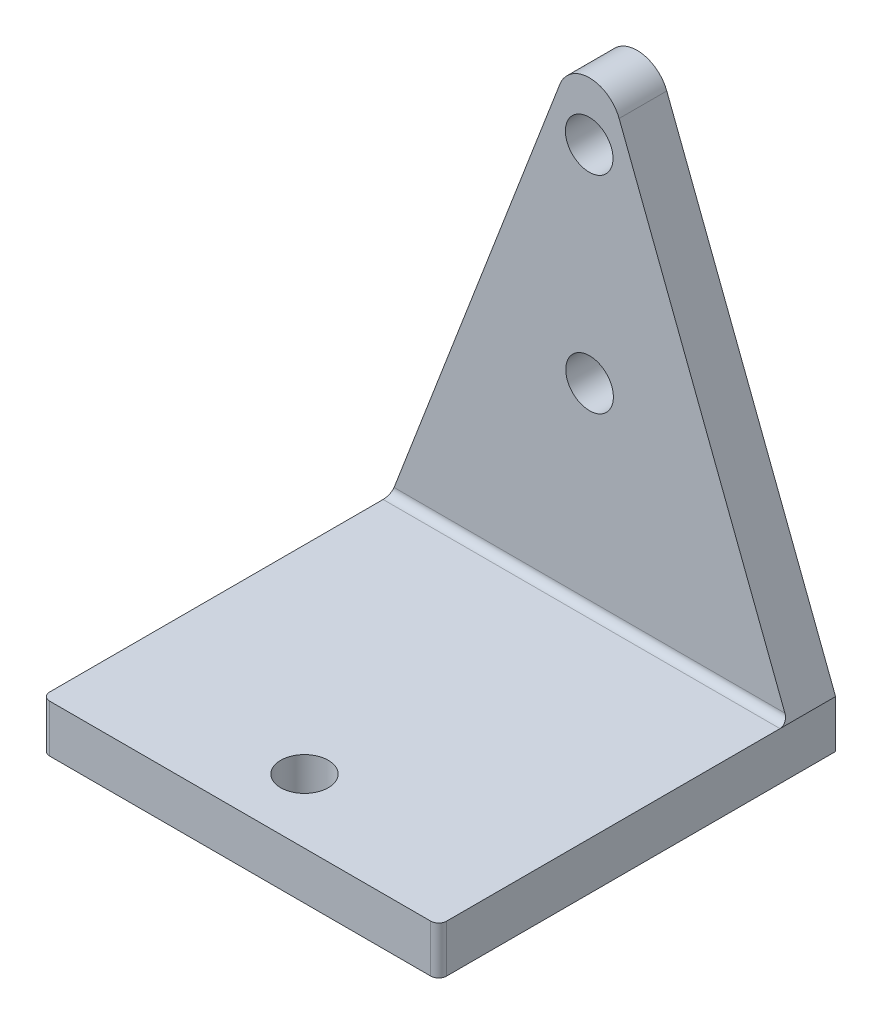
ISO-10303-21;
HEADER;
FILE_DESCRIPTION(('STEP AP214'),'2;1');
FILE_NAME('part.step','',(''),(''),'','','');
FILE_SCHEMA(('AUTOMOTIVE_DESIGN { 1 0 10303 214 1 1 1 1 }'));
ENDSEC;
DATA;
#1=APPLICATION_CONTEXT('core data for automotive mechanical design processes');
#2=APPLICATION_PROTOCOL_DEFINITION('international standard','automotive_design',2000,#1);
#3=PRODUCT_CONTEXT('',#1,'mechanical');
#4=PRODUCT('Part','Part','',(#3));
#5=PRODUCT_RELATED_PRODUCT_CATEGORY('part','',(#4));
#6=PRODUCT_DEFINITION_FORMATION('','',#4);
#7=PRODUCT_DEFINITION_CONTEXT('part definition',#1,'design');
#8=PRODUCT_DEFINITION('design','',#6,#7);
#9=PRODUCT_DEFINITION_SHAPE('','',#8);
#10=(LENGTH_UNIT() NAMED_UNIT(*) SI_UNIT(.MILLI.,.METRE.));
#11=(NAMED_UNIT(*) PLANE_ANGLE_UNIT() SI_UNIT($,.RADIAN.));
#12=(NAMED_UNIT(*) SI_UNIT($,.STERADIAN.) SOLID_ANGLE_UNIT());
#13=UNCERTAINTY_MEASURE_WITH_UNIT(LENGTH_MEASURE(1.E-05),#10,'distance_accuracy_value','');
#14=(GEOMETRIC_REPRESENTATION_CONTEXT(3) GLOBAL_UNCERTAINTY_ASSIGNED_CONTEXT((#13)) GLOBAL_UNIT_ASSIGNED_CONTEXT((#10,
#11,#12)) REPRESENTATION_CONTEXT('',''));
#15=CARTESIAN_POINT('',(0.,0.,0.));
#16=DIRECTION('',(0.,0.,1.));
#17=DIRECTION('',(1.,0.,0.));
#18=AXIS2_PLACEMENT_3D('',#15,#16,#17);
#19=CARTESIAN_POINT('',(125.,30.,125.));
#20=DIRECTION('',(0.,1.,0.));
#21=DIRECTION('',(0.,0.,1.));
#22=AXIS2_PLACEMENT_3D('',#19,#20,#21);
#23=PLANE('',#22);
#24=CARTESIAN_POINT('',(0.,30.,84.5076740791228));
#25=DIRECTION('',(0.,1.,0.));
#26=DIRECTION('',(0.,0.,1.));
#27=AXIS2_PLACEMENT_3D('',#24,#25,#26);
#28=CIRCLE('',#27,15.);
#29=CARTESIAN_POINT('',(0.,30.,99.5076740791228));
#30=VERTEX_POINT('',#29);
#31=EDGE_CURVE('E414',#30,#30,#28,.T.);
#32=ORIENTED_EDGE('',*,*,#31,.F.);
#33=EDGE_LOOP('',(#32));
#34=FACE_BOUND('',#33,.T.);
#35=DIRECTION('',(0.,0.,1.));
#36=VECTOR('',#35,1.);
#37=CARTESIAN_POINT('',(-125.,30.,-125.));
#38=LINE('',#37,#36);
#39=CARTESIAN_POINT('',(-125.,30.,-90.));
#40=VERTEX_POINT('',#39);
#41=CARTESIAN_POINT('',(-125.,30.,120.));
#42=VERTEX_POINT('',#41);
#43=EDGE_CURVE('E175',#40,#42,#38,.T.);
#44=ORIENTED_EDGE('',*,*,#43,.T.);
#45=CARTESIAN_POINT('',(-120.,30.,120.));
#46=DIRECTION('',(0.,1.,0.));
#47=DIRECTION('',(0.,0.,1.));
#48=AXIS2_PLACEMENT_3D('',#45,#46,#47);
#49=CIRCLE('',#48,5.);
#50=CARTESIAN_POINT('',(-120.,30.,125.));
#51=VERTEX_POINT('',#50);
#52=EDGE_CURVE('E48',#42,#51,#49,.T.);
#53=ORIENTED_EDGE('',*,*,#52,.T.);
#54=DIRECTION('',(1.,0.,0.));
#55=VECTOR('',#54,1.);
#56=CARTESIAN_POINT('',(-125.,30.,125.));
#57=LINE('',#56,#55);
#58=CARTESIAN_POINT('',(120.,30.,125.));
#59=VERTEX_POINT('',#58);
#60=EDGE_CURVE('E182',#51,#59,#57,.T.);
#61=ORIENTED_EDGE('',*,*,#60,.T.);
#62=CARTESIAN_POINT('',(120.,30.,120.));
#63=DIRECTION('',(0.,1.,0.));
#64=DIRECTION('',(0.,0.,1.));
#65=AXIS2_PLACEMENT_3D('',#62,#63,#64);
#66=CIRCLE('',#65,5.);
#67=CARTESIAN_POINT('',(125.,30.,120.));
#68=VERTEX_POINT('',#67);
#69=EDGE_CURVE('E55',#59,#68,#66,.T.);
#70=ORIENTED_EDGE('',*,*,#69,.T.);
#71=DIRECTION('',(0.,0.,-1.));
#72=VECTOR('',#71,1.);
#73=CARTESIAN_POINT('',(125.,30.,-125.));
#74=LINE('',#73,#72);
#75=CARTESIAN_POINT('',(125.,30.,-90.));
#76=VERTEX_POINT('',#75);
#77=EDGE_CURVE('E171',#68,#76,#74,.T.);
#78=ORIENTED_EDGE('',*,*,#77,.T.);
#79=DIRECTION('',(-1.,0.,0.));
#80=VECTOR('',#79,1.);
#81=CARTESIAN_POINT('',(125.,30.,-90.));
#82=LINE('',#81,#80);
#83=EDGE_CURVE('E235',#76,#40,#82,.T.);
#84=ORIENTED_EDGE('',*,*,#83,.T.);
#85=EDGE_LOOP('',(#44,#53,#61,#70,#78,#84));
#86=FACE_BOUND('',#85,.T.);
#87=ADVANCED_FACE('F39',(#34,#86),#23,.T.);
#88=CARTESIAN_POINT('',(125.,30.,-125.));
#89=DIRECTION('',(-1.,0.,0.));
#90=DIRECTION('',(0.,0.,1.));
#91=AXIS2_PLACEMENT_3D('',#88,#89,#90);
#92=PLANE('',#91);
#93=ORIENTED_EDGE('',*,*,#77,.F.);
#94=DIRECTION('',(0.,-1.,0.));
#95=VECTOR('',#94,1.);
#96=CARTESIAN_POINT('',(125.,30.,120.));
#97=LINE('',#96,#95);
#98=CARTESIAN_POINT('',(125.,0.,120.));
#99=VERTEX_POINT('',#98);
#100=EDGE_CURVE('E11',#68,#99,#97,.T.);
#101=ORIENTED_EDGE('',*,*,#100,.T.);
#102=DIRECTION('',(0.,0.,-1.));
#103=VECTOR('',#102,1.);
#104=CARTESIAN_POINT('',(125.,0.,-125.));
#105=LINE('',#104,#103);
#106=CARTESIAN_POINT('',(125.,0.,-125.));
#107=VERTEX_POINT('',#106);
#108=EDGE_CURVE('E225',#99,#107,#105,.T.);
#109=ORIENTED_EDGE('',*,*,#108,.T.);
#110=DIRECTION('',(0.,-1.,0.));
#111=VECTOR('',#110,1.);
#112=CARTESIAN_POINT('',(125.,30.,-125.));
#113=LINE('',#112,#111);
#114=CARTESIAN_POINT('',(125.,30.,-125.));
#115=VERTEX_POINT('',#114);
#116=EDGE_CURVE('E231',#115,#107,#113,.T.);
#117=ORIENTED_EDGE('',*,*,#116,.F.);
#118=DIRECTION('',(0.,0.,-1.));
#119=VECTOR('',#118,1.);
#120=CARTESIAN_POINT('',(125.,30.,-95.));
#121=LINE('',#120,#119);
#122=EDGE_CURVE('E164',#76,#115,#121,.T.);
#123=ORIENTED_EDGE('',*,*,#122,.F.);
#124=EDGE_LOOP('',(#93,#101,#109,#117,#123));
#125=FACE_BOUND('',#124,.T.);
#126=ADVANCED_FACE('F270',(#125),#92,.F.);
#127=CARTESIAN_POINT('',(-125.,30.,-125.));
#128=DIRECTION('',(0.,0.,1.));
#129=DIRECTION('',(1.,0.,0.));
#130=AXIS2_PLACEMENT_3D('',#127,#128,#129);
#131=PLANE('',#130);
#132=CARTESIAN_POINT('',(0.0502246308684562,153.429955132945,-125.));
#133=DIRECTION('',(0.,0.,1.));
#134=DIRECTION('',(1.,0.,0.));
#135=AXIS2_PLACEMENT_3D('',#132,#133,#134);
#136=CIRCLE('',#135,15.);
#137=CARTESIAN_POINT('',(15.0502246308685,153.429955132945,-125.));
#138=VERTEX_POINT('',#137);
#139=EDGE_CURVE('E157',#138,#138,#136,.T.);
#140=ORIENTED_EDGE('',*,*,#139,.T.);
#141=EDGE_LOOP('',(#140));
#142=FACE_BOUND('',#141,.T.);
#143=CARTESIAN_POINT('',(-0.186934905475056,283.429955132945,-125.));
#144=DIRECTION('',(0.,0.,1.));
#145=DIRECTION('',(1.,0.,0.));
#146=AXIS2_PLACEMENT_3D('',#143,#144,#145);
#147=CIRCLE('',#146,15.);
#148=CARTESIAN_POINT('',(14.813065094525,283.429955132945,-125.));
#149=VERTEX_POINT('',#148);
#150=EDGE_CURVE('E152',#149,#149,#147,.T.);
#151=ORIENTED_EDGE('',*,*,#150,.T.);
#152=EDGE_LOOP('',(#151));
#153=FACE_BOUND('',#152,.T.);
#154=DIRECTION('',(-1.,0.,0.));
#155=VECTOR('',#154,1.);
#156=CARTESIAN_POINT('',(-125.,0.,-125.));
#157=LINE('',#156,#155);
#158=CARTESIAN_POINT('',(-125.,0.,-125.));
#159=VERTEX_POINT('',#158);
#160=EDGE_CURVE('E220',#107,#159,#157,.T.);
#161=ORIENTED_EDGE('',*,*,#160,.T.);
#162=DIRECTION('',(0.,-1.,0.));
#163=VECTOR('',#162,1.);
#164=CARTESIAN_POINT('',(-125.,30.,-125.));
#165=LINE('',#164,#163);
#166=CARTESIAN_POINT('',(-125.,30.,-125.));
#167=VERTEX_POINT('',#166);
#168=EDGE_CURVE('E195',#167,#159,#165,.T.);
#169=ORIENTED_EDGE('',*,*,#168,.F.);
#170=DIRECTION('',(0.358173612222462,0.933655002400519,0.));
#171=VECTOR('',#170,1.);
#172=CARTESIAN_POINT('',(-125.,30.,-125.));
#173=LINE('',#172,#171);
#174=CARTESIAN_POINT('',(-18.6731000480104,307.163472244449,-125.));
#175=VERTEX_POINT('',#174);
#176=EDGE_CURVE('E154',#167,#175,#173,.T.);
#177=ORIENTED_EDGE('',*,*,#176,.T.);
#178=CARTESIAN_POINT('',(0.,300.,-125.));
#179=DIRECTION('',(0.,0.,-1.));
#180=DIRECTION('',(-1.,0.,0.));
#181=AXIS2_PLACEMENT_3D('',#178,#179,#180);
#182=CIRCLE('',#181,20.);
#183=CARTESIAN_POINT('',(18.6731000480104,307.163472244449,-125.));
#184=VERTEX_POINT('',#183);
#185=EDGE_CURVE('E138',#175,#184,#182,.T.);
#186=ORIENTED_EDGE('',*,*,#185,.T.);
#187=DIRECTION('',(0.358173612222462,-0.933655002400519,0.));
#188=VECTOR('',#187,1.);
#189=CARTESIAN_POINT('',(125.,30.,-125.));
#190=LINE('',#189,#188);
#191=EDGE_CURVE('E131',#184,#115,#190,.T.);
#192=ORIENTED_EDGE('',*,*,#191,.T.);
#193=ORIENTED_EDGE('',*,*,#116,.T.);
#194=EDGE_LOOP('',(#161,#169,#177,#186,#192,#193));
#195=FACE_BOUND('',#194,.T.);
#196=ADVANCED_FACE('F264',(#142,#153,#195),#131,.F.);
#197=CARTESIAN_POINT('',(-125.,30.,-125.));
#198=DIRECTION('',(1.,0.,0.));
#199=DIRECTION('',(0.,0.,-1.));
#200=AXIS2_PLACEMENT_3D('',#197,#198,#199);
#201=PLANE('',#200);
#202=DIRECTION('',(0.,0.,1.));
#203=VECTOR('',#202,1.);
#204=CARTESIAN_POINT('',(-125.,0.,-125.));
#205=LINE('',#204,#203);
#206=CARTESIAN_POINT('',(-125.,0.,120.));
#207=VERTEX_POINT('',#206);
#208=EDGE_CURVE('E214',#159,#207,#205,.T.);
#209=ORIENTED_EDGE('',*,*,#208,.T.);
#210=DIRECTION('',(0.,-1.,0.));
#211=VECTOR('',#210,1.);
#212=CARTESIAN_POINT('',(-125.,30.,120.));
#213=LINE('',#212,#211);
#214=EDGE_CURVE('E63',#207,#42,#213,.F.);
#215=ORIENTED_EDGE('',*,*,#214,.T.);
#216=ORIENTED_EDGE('',*,*,#43,.F.);
#217=EDGE_CURVE('E196',#167,#40,#38,.T.);
#218=ORIENTED_EDGE('',*,*,#217,.F.);
#219=ORIENTED_EDGE('',*,*,#168,.T.);
#220=EDGE_LOOP('',(#209,#215,#216,#218,#219));
#221=FACE_BOUND('',#220,.T.);
#222=ADVANCED_FACE('F216',(#221),#201,.F.);
#223=CARTESIAN_POINT('',(-125.,30.,125.));
#224=DIRECTION('',(0.,0.,-1.));
#225=DIRECTION('',(-1.,0.,0.));
#226=AXIS2_PLACEMENT_3D('',#223,#224,#225);
#227=PLANE('',#226);
#228=ORIENTED_EDGE('',*,*,#60,.F.);
#229=DIRECTION('',(0.,-1.,0.));
#230=VECTOR('',#229,1.);
#231=CARTESIAN_POINT('',(-120.,30.,125.));
#232=LINE('',#231,#230);
#233=CARTESIAN_POINT('',(-120.,0.,125.));
#234=VERTEX_POINT('',#233);
#235=EDGE_CURVE('E190',#51,#234,#232,.T.);
#236=ORIENTED_EDGE('',*,*,#235,.T.);
#237=DIRECTION('',(1.,0.,0.));
#238=VECTOR('',#237,1.);
#239=CARTESIAN_POINT('',(-125.,0.,125.));
#240=LINE('',#239,#238);
#241=CARTESIAN_POINT('',(120.,0.,125.));
#242=VERTEX_POINT('',#241);
#243=EDGE_CURVE('E176',#234,#242,#240,.T.);
#244=ORIENTED_EDGE('',*,*,#243,.T.);
#245=DIRECTION('',(0.,-1.,0.));
#246=VECTOR('',#245,1.);
#247=CARTESIAN_POINT('',(120.,30.,125.));
#248=LINE('',#247,#246);
#249=EDGE_CURVE('E193',#242,#59,#248,.F.);
#250=ORIENTED_EDGE('',*,*,#249,.T.);
#251=EDGE_LOOP('',(#228,#236,#244,#250));
#252=FACE_BOUND('',#251,.T.);
#253=ADVANCED_FACE('F188',(#252),#227,.F.);
#254=CARTESIAN_POINT('',(125.,0.,125.));
#255=DIRECTION('',(0.,1.,0.));
#256=DIRECTION('',(0.,0.,1.));
#257=AXIS2_PLACEMENT_3D('',#254,#255,#256);
#258=PLANE('',#257);
#259=CARTESIAN_POINT('',(0.,0.,84.5076740791228));
#260=DIRECTION('',(0.,1.,0.));
#261=DIRECTION('',(0.,0.,1.));
#262=AXIS2_PLACEMENT_3D('',#259,#260,#261);
#263=CIRCLE('',#262,15.);
#264=CARTESIAN_POINT('',(0.,0.,99.5076740791228));
#265=VERTEX_POINT('',#264);
#266=EDGE_CURVE('E412',#265,#265,#263,.T.);
#267=ORIENTED_EDGE('',*,*,#266,.T.);
#268=EDGE_LOOP('',(#267));
#269=FACE_BOUND('',#268,.T.);
#270=ORIENTED_EDGE('',*,*,#243,.F.);
#271=CARTESIAN_POINT('',(-120.,0.,120.));
#272=DIRECTION('',(0.,1.,0.));
#273=DIRECTION('',(0.,0.,1.));
#274=AXIS2_PLACEMENT_3D('',#271,#272,#273);
#275=CIRCLE('',#274,5.);
#276=EDGE_CURVE('E198',#234,#207,#275,.F.);
#277=ORIENTED_EDGE('',*,*,#276,.T.);
#278=ORIENTED_EDGE('',*,*,#208,.F.);
#279=ORIENTED_EDGE('',*,*,#160,.F.);
#280=ORIENTED_EDGE('',*,*,#108,.F.);
#281=CARTESIAN_POINT('',(120.,0.,120.));
#282=DIRECTION('',(0.,1.,0.));
#283=DIRECTION('',(0.,0.,1.));
#284=AXIS2_PLACEMENT_3D('',#281,#282,#283);
#285=CIRCLE('',#284,5.);
#286=EDGE_CURVE('E200',#99,#242,#285,.F.);
#287=ORIENTED_EDGE('',*,*,#286,.T.);
#288=EDGE_LOOP('',(#270,#277,#278,#279,#280,#287));
#289=FACE_BOUND('',#288,.T.);
#290=ADVANCED_FACE('F212',(#269,#289),#258,.F.);
#291=CARTESIAN_POINT('',(125.,30.,-95.));
#292=DIRECTION('',(0.933655002400519,0.358173612222462,0.));
#293=DIRECTION('',(-0.358173612222462,0.933655002400519,0.));
#294=AXIS2_PLACEMENT_3D('',#291,#292,#293);
#295=PLANE('',#294);
#296=ORIENTED_EDGE('',*,*,#191,.F.);
#297=DIRECTION('',(0.,0.,-1.));
#298=VECTOR('',#297,1.);
#299=CARTESIAN_POINT('',(18.6731000480104,307.163472244449,-95.));
#300=LINE('',#299,#298);
#301=CARTESIAN_POINT('',(18.6731000480104,307.163472244449,-95.));
#302=VERTEX_POINT('',#301);
#303=EDGE_CURVE('E141',#302,#184,#300,.T.);
#304=ORIENTED_EDGE('',*,*,#303,.F.);
#305=DIRECTION('',(0.358173612222462,-0.933655002400519,0.));
#306=VECTOR('',#305,1.);
#307=CARTESIAN_POINT('',(125.,30.,-95.));
#308=LINE('',#307,#306);
#309=CARTESIAN_POINT('',(123.08187386507,35.,-95.));
#310=VERTEX_POINT('',#309);
#311=EDGE_CURVE('E142',#302,#310,#308,.T.);
#312=ORIENTED_EDGE('',*,*,#311,.T.);
#313=CARTESIAN_POINT('',(123.08187386507,35.,-90.));
#314=DIRECTION('',(0.933655002400519,0.358173612222462,0.));
#315=DIRECTION('',(-0.358173612222462,0.933655002400519,0.));
#316=AXIS2_PLACEMENT_3D('',#313,#314,#315);
#317=ELLIPSE('',#316,5.35529717844868,5.);
#318=EDGE_CURVE('E205',#310,#76,#317,.F.);
#319=ORIENTED_EDGE('',*,*,#318,.T.);
#320=ORIENTED_EDGE('',*,*,#122,.T.);
#321=EDGE_LOOP('',(#296,#304,#312,#319,#320));
#322=FACE_BOUND('',#321,.T.);
#323=ADVANCED_FACE('F254',(#322),#295,.T.);
#324=CARTESIAN_POINT('',(0.,300.,-95.));
#325=DIRECTION('',(0.,0.,-1.));
#326=DIRECTION('',(-1.,0.,0.));
#327=AXIS2_PLACEMENT_3D('',#324,#325,#326);
#328=CYLINDRICAL_SURFACE('',#327,20.);
#329=ORIENTED_EDGE('',*,*,#185,.F.);
#330=DIRECTION('',(0.,0.,-1.));
#331=VECTOR('',#330,1.);
#332=CARTESIAN_POINT('',(-18.6731000480104,307.163472244449,-95.));
#333=LINE('',#332,#331);
#334=CARTESIAN_POINT('',(-18.6731000480104,307.163472244449,-95.));
#335=VERTEX_POINT('',#334);
#336=EDGE_CURVE('E122',#335,#175,#333,.T.);
#337=ORIENTED_EDGE('',*,*,#336,.F.);
#338=CARTESIAN_POINT('',(0.,300.,-95.));
#339=DIRECTION('',(0.,0.,-1.));
#340=DIRECTION('',(-1.,0.,0.));
#341=AXIS2_PLACEMENT_3D('',#338,#339,#340);
#342=CIRCLE('',#341,20.);
#343=EDGE_CURVE('E130',#335,#302,#342,.T.);
#344=ORIENTED_EDGE('',*,*,#343,.T.);
#345=ORIENTED_EDGE('',*,*,#303,.T.);
#346=EDGE_LOOP('',(#329,#337,#344,#345));
#347=FACE_BOUND('',#346,.T.);
#348=ADVANCED_FACE('F135',(#347),#328,.T.);
#349=CARTESIAN_POINT('',(-125.,30.,-95.));
#350=DIRECTION('',(-0.933655002400519,0.358173612222462,0.));
#351=DIRECTION('',(-0.358173612222462,-0.933655002400519,0.));
#352=AXIS2_PLACEMENT_3D('',#349,#350,#351);
#353=PLANE('',#352);
#354=ORIENTED_EDGE('',*,*,#176,.F.);
#355=ORIENTED_EDGE('',*,*,#217,.T.);
#356=CARTESIAN_POINT('',(-123.08187386507,35.,-90.));
#357=DIRECTION('',(-0.933655002400519,0.358173612222462,0.));
#358=DIRECTION('',(-0.358173612222462,-0.933655002400519,0.));
#359=AXIS2_PLACEMENT_3D('',#356,#357,#358);
#360=ELLIPSE('',#359,5.35529717844868,5.);
#361=CARTESIAN_POINT('',(-123.08187386507,35.,-95.));
#362=VERTEX_POINT('',#361);
#363=EDGE_CURVE('E125',#40,#362,#360,.F.);
#364=ORIENTED_EDGE('',*,*,#363,.T.);
#365=DIRECTION('',(0.358173612222462,0.933655002400519,0.));
#366=VECTOR('',#365,1.);
#367=CARTESIAN_POINT('',(-125.,30.,-95.));
#368=LINE('',#367,#366);
#369=EDGE_CURVE('E119',#362,#335,#368,.T.);
#370=ORIENTED_EDGE('',*,*,#369,.T.);
#371=ORIENTED_EDGE('',*,*,#336,.T.);
#372=EDGE_LOOP('',(#354,#355,#364,#370,#371));
#373=FACE_BOUND('',#372,.T.);
#374=ADVANCED_FACE('F121',(#373),#353,.T.);
#375=CARTESIAN_POINT('',(0.,300.,-95.));
#376=DIRECTION('',(0.,0.,-1.));
#377=DIRECTION('',(-1.,0.,0.));
#378=AXIS2_PLACEMENT_3D('',#375,#376,#377);
#379=PLANE('',#378);
#380=CARTESIAN_POINT('',(0.0502246308684562,153.429955132945,-95.));
#381=DIRECTION('',(0.,0.,1.));
#382=DIRECTION('',(1.,0.,0.));
#383=AXIS2_PLACEMENT_3D('',#380,#381,#382);
#384=CIRCLE('',#383,15.);
#385=CARTESIAN_POINT('',(15.0502246308685,153.429955132945,-95.));
#386=VERTEX_POINT('',#385);
#387=EDGE_CURVE('E423',#386,#386,#384,.T.);
#388=ORIENTED_EDGE('',*,*,#387,.F.);
#389=EDGE_LOOP('',(#388));
#390=FACE_BOUND('',#389,.T.);
#391=CARTESIAN_POINT('',(-0.186934905475056,283.429955132945,-95.));
#392=DIRECTION('',(0.,0.,1.));
#393=DIRECTION('',(1.,0.,0.));
#394=AXIS2_PLACEMENT_3D('',#391,#392,#393);
#395=CIRCLE('',#394,15.);
#396=CARTESIAN_POINT('',(14.813065094525,283.429955132945,-95.));
#397=VERTEX_POINT('',#396);
#398=EDGE_CURVE('E426',#397,#397,#395,.T.);
#399=ORIENTED_EDGE('',*,*,#398,.F.);
#400=EDGE_LOOP('',(#399));
#401=FACE_BOUND('',#400,.T.);
#402=ORIENTED_EDGE('',*,*,#369,.F.);
#403=DIRECTION('',(-1.,0.,0.));
#404=VECTOR('',#403,1.);
#405=CARTESIAN_POINT('',(0.,35.,-95.));
#406=LINE('',#405,#404);
#407=EDGE_CURVE('E244',#362,#310,#406,.F.);
#408=ORIENTED_EDGE('',*,*,#407,.T.);
#409=ORIENTED_EDGE('',*,*,#311,.F.);
#410=ORIENTED_EDGE('',*,*,#343,.F.);
#411=EDGE_LOOP('',(#402,#408,#409,#410));
#412=FACE_BOUND('',#411,.T.);
#413=ADVANCED_FACE('F144',(#390,#401,#412),#379,.F.);
#414=CARTESIAN_POINT('',(125.,35.,-90.));
#415=DIRECTION('',(-1.,0.,0.));
#416=DIRECTION('',(0.,0.,1.));
#417=AXIS2_PLACEMENT_3D('',#414,#415,#416);
#418=CYLINDRICAL_SURFACE('',#417,5.);
#419=ORIENTED_EDGE('',*,*,#318,.F.);
#420=ORIENTED_EDGE('',*,*,#407,.F.);
#421=ORIENTED_EDGE('',*,*,#363,.F.);
#422=ORIENTED_EDGE('',*,*,#83,.F.);
#423=EDGE_LOOP('',(#419,#420,#421,#422));
#424=FACE_BOUND('',#423,.T.);
#425=ADVANCED_FACE('F257',(#424),#418,.F.);
#426=CARTESIAN_POINT('',(-120.,30.,120.));
#427=DIRECTION('',(0.,-1.,0.));
#428=DIRECTION('',(0.,0.,-1.));
#429=AXIS2_PLACEMENT_3D('',#426,#427,#428);
#430=CYLINDRICAL_SURFACE('',#429,5.);
#431=ORIENTED_EDGE('',*,*,#52,.F.);
#432=ORIENTED_EDGE('',*,*,#214,.F.);
#433=ORIENTED_EDGE('',*,*,#276,.F.);
#434=ORIENTED_EDGE('',*,*,#235,.F.);
#435=EDGE_LOOP('',(#431,#432,#433,#434));
#436=FACE_BOUND('',#435,.T.);
#437=ADVANCED_FACE('F197',(#436),#430,.T.);
#438=CARTESIAN_POINT('',(120.,30.,120.));
#439=DIRECTION('',(0.,-1.,0.));
#440=DIRECTION('',(0.,0.,-1.));
#441=AXIS2_PLACEMENT_3D('',#438,#439,#440);
#442=CYLINDRICAL_SURFACE('',#441,5.);
#443=ORIENTED_EDGE('',*,*,#69,.F.);
#444=ORIENTED_EDGE('',*,*,#249,.F.);
#445=ORIENTED_EDGE('',*,*,#286,.F.);
#446=ORIENTED_EDGE('',*,*,#100,.F.);
#447=EDGE_LOOP('',(#443,#444,#445,#446));
#448=FACE_BOUND('',#447,.T.);
#449=ADVANCED_FACE('F41',(#448),#442,.T.);
#450=CARTESIAN_POINT('',(-0.186934905475056,283.429955132945,-125.));
#451=DIRECTION('',(0.,0.,1.));
#452=DIRECTION('',(1.,0.,0.));
#453=AXIS2_PLACEMENT_3D('',#450,#451,#452);
#454=CYLINDRICAL_SURFACE('',#453,15.);
#455=ORIENTED_EDGE('',*,*,#150,.F.);
#456=EDGE_LOOP('',(#455));
#457=FACE_BOUND('',#456,.T.);
#458=ORIENTED_EDGE('',*,*,#398,.T.);
#459=EDGE_LOOP('',(#458));
#460=FACE_BOUND('',#459,.T.);
#461=ADVANCED_FACE('F274',(#457,#460),#454,.F.);
#462=CARTESIAN_POINT('',(0.0502246308684562,153.429955132945,-125.));
#463=DIRECTION('',(0.,0.,1.));
#464=DIRECTION('',(1.,0.,0.));
#465=AXIS2_PLACEMENT_3D('',#462,#463,#464);
#466=CYLINDRICAL_SURFACE('',#465,15.);
#467=ORIENTED_EDGE('',*,*,#139,.F.);
#468=EDGE_LOOP('',(#467));
#469=FACE_BOUND('',#468,.T.);
#470=ORIENTED_EDGE('',*,*,#387,.T.);
#471=EDGE_LOOP('',(#470));
#472=FACE_BOUND('',#471,.T.);
#473=ADVANCED_FACE('F279',(#469,#472),#466,.F.);
#474=CARTESIAN_POINT('',(0.,0.,84.5076740791228));
#475=DIRECTION('',(0.,1.,0.));
#476=DIRECTION('',(0.,0.,1.));
#477=AXIS2_PLACEMENT_3D('',#474,#475,#476);
#478=CYLINDRICAL_SURFACE('',#477,15.);
#479=ORIENTED_EDGE('',*,*,#266,.F.);
#480=EDGE_LOOP('',(#479));
#481=FACE_BOUND('',#480,.T.);
#482=ORIENTED_EDGE('',*,*,#31,.T.);
#483=EDGE_LOOP('',(#482));
#484=FACE_BOUND('',#483,.T.);
#485=ADVANCED_FACE('F378',(#481,#484),#478,.F.);
#486=CLOSED_SHELL('',(#87,#126,#196,#222,#253,#290,#323,#348,#374,#413,#425,#437,#449,#461,#473,#485));
#487=MANIFOLD_SOLID_BREP('B2',#486);
#488=ADVANCED_BREP_SHAPE_REPRESENTATION('',(#18,#487),#14);
#489=SHAPE_DEFINITION_REPRESENTATION(#9,#488);
ENDSEC;
END-ISO-10303-21;
